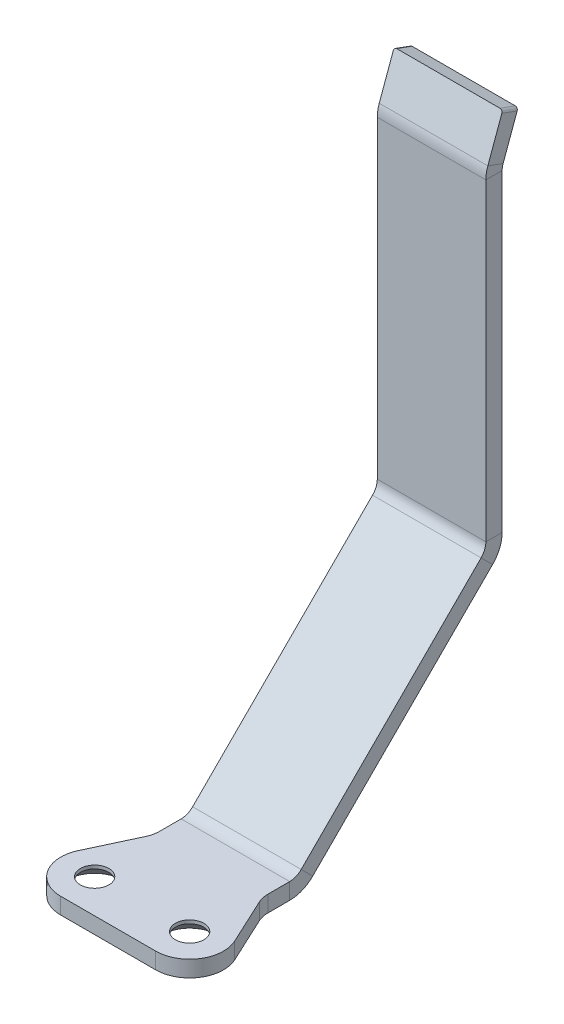
ISO-10303-21;
HEADER;
FILE_DESCRIPTION(('STEP AP214'),'2;1');
FILE_NAME('part.step','',(''),(''),'','','');
FILE_SCHEMA(('AUTOMOTIVE_DESIGN { 1 0 10303 214 1 1 1 1 }'));
ENDSEC;
DATA;
#1=APPLICATION_CONTEXT('core data for automotive mechanical design processes');
#2=APPLICATION_PROTOCOL_DEFINITION('international standard','automotive_design',2000,#1);
#3=PRODUCT_CONTEXT('',#1,'mechanical');
#4=PRODUCT('Part','Part','',(#3));
#5=PRODUCT_RELATED_PRODUCT_CATEGORY('part','',(#4));
#6=PRODUCT_DEFINITION_FORMATION('','',#4);
#7=PRODUCT_DEFINITION_CONTEXT('part definition',#1,'design');
#8=PRODUCT_DEFINITION('design','',#6,#7);
#9=PRODUCT_DEFINITION_SHAPE('','',#8);
#10=(LENGTH_UNIT() NAMED_UNIT(*) SI_UNIT(.MILLI.,.METRE.));
#11=(NAMED_UNIT(*) PLANE_ANGLE_UNIT() SI_UNIT($,.RADIAN.));
#12=(NAMED_UNIT(*) SI_UNIT($,.STERADIAN.) SOLID_ANGLE_UNIT());
#13=UNCERTAINTY_MEASURE_WITH_UNIT(LENGTH_MEASURE(1.E-05),#10,'distance_accuracy_value','');
#14=(GEOMETRIC_REPRESENTATION_CONTEXT(3) GLOBAL_UNCERTAINTY_ASSIGNED_CONTEXT((#13)) GLOBAL_UNIT_ASSIGNED_CONTEXT((#10,
#11,#12)) REPRESENTATION_CONTEXT('',''));
#15=CARTESIAN_POINT('',(0.,0.,0.));
#16=DIRECTION('',(0.,0.,1.));
#17=DIRECTION('',(1.,0.,0.));
#18=AXIS2_PLACEMENT_3D('',#15,#16,#17);
#19=CARTESIAN_POINT('',(-19.,287.841217847367,-0.231610237586444));
#20=DIRECTION('',(0.,-0.939692620785908,0.342020143325669));
#21=DIRECTION('',(0.,-0.342020143325669,-0.939692620785908));
#22=AXIS2_PLACEMENT_3D('',#19,#20,#21);
#23=PLANE('',#22);
#24=DIRECTION('',(-1.,0.,0.));
#25=VECTOR('',#24,1.);
#26=CARTESIAN_POINT('',(-19.,285.789096987413,-5.86976596230189));
#27=LINE('',#26,#25);
#28=CARTESIAN_POINT('',(19.,285.789096987413,-5.86976596230189));
#29=VERTEX_POINT('',#28);
#30=CARTESIAN_POINT('',(-19.,285.789096987413,-5.86976596230189));
#31=VERTEX_POINT('',#30);
#32=EDGE_CURVE('E255',#29,#31,#27,.T.);
#33=ORIENTED_EDGE('',*,*,#32,.T.);
#34=DIRECTION('',(0.,-0.342020143325669,-0.939692620785908));
#35=VECTOR('',#34,1.);
#36=CARTESIAN_POINT('',(-19.,287.841217847367,-0.231610237586444));
#37=LINE('',#36,#35);
#38=CARTESIAN_POINT('',(-19.,287.841217847367,-0.231610237586444));
#39=VERTEX_POINT('',#38);
#40=EDGE_CURVE('E466',#39,#31,#37,.T.);
#41=ORIENTED_EDGE('',*,*,#40,.F.);
#42=DIRECTION('',(-1.,0.,0.));
#43=VECTOR('',#42,1.);
#44=CARTESIAN_POINT('',(-19.,287.841217847367,-0.231610237586444));
#45=LINE('',#44,#43);
#46=CARTESIAN_POINT('',(19.,287.841217847367,-0.231610237586444));
#47=VERTEX_POINT('',#46);
#48=EDGE_CURVE('E457',#47,#39,#45,.T.);
#49=ORIENTED_EDGE('',*,*,#48,.F.);
#50=DIRECTION('',(0.,-0.342020143325669,-0.939692620785908));
#51=VECTOR('',#50,1.);
#52=CARTESIAN_POINT('',(19.,287.841217847367,-0.231610237586444));
#53=LINE('',#52,#51);
#54=EDGE_CURVE('E257',#47,#29,#53,.T.);
#55=ORIENTED_EDGE('',*,*,#54,.T.);
#56=EDGE_LOOP('',(#33,#41,#49,#55));
#57=FACE_BOUND('',#56,.T.);
#58=ADVANCED_FACE('F32',(#57),#23,.F.);
#59=CARTESIAN_POINT('',(19.,286.901525226582,0.110409905739225));
#60=DIRECTION('',(0.,-0.342020143325669,-0.939692620785908));
#61=DIRECTION('',(-1.,0.,0.));
#62=AXIS2_PLACEMENT_3D('',#59,#60,#61);
#63=CYLINDRICAL_SURFACE('',#62,1.);
#64=CARTESIAN_POINT('',(19.,284.849404366628,-5.52774581897622));
#65=DIRECTION('',(0.,0.342020143325669,0.939692620785908));
#66=DIRECTION('',(1.,0.,0.));
#67=AXIS2_PLACEMENT_3D('',#64,#65,#66);
#68=CIRCLE('',#67,1.);
#69=CARTESIAN_POINT('',(20.,284.849404366628,-5.52774581897622));
#70=VERTEX_POINT('',#69);
#71=EDGE_CURVE('E474',#70,#29,#68,.T.);
#72=ORIENTED_EDGE('',*,*,#71,.T.);
#73=ORIENTED_EDGE('',*,*,#54,.F.);
#74=CARTESIAN_POINT('',(19.,286.901525226582,0.110409905739225));
#75=DIRECTION('',(0.,0.342020143325669,0.939692620785908));
#76=DIRECTION('',(1.,0.,0.));
#77=AXIS2_PLACEMENT_3D('',#74,#75,#76);
#78=CIRCLE('',#77,1.);
#79=CARTESIAN_POINT('',(20.,286.901525226582,0.110409905739225));
#80=VERTEX_POINT('',#79);
#81=EDGE_CURVE('E459',#80,#47,#78,.T.);
#82=ORIENTED_EDGE('',*,*,#81,.F.);
#83=DIRECTION('',(0.,-0.342020143325669,-0.939692620785908));
#84=VECTOR('',#83,1.);
#85=CARTESIAN_POINT('',(20.,286.901525226582,0.110409905739225));
#86=LINE('',#85,#84);
#87=EDGE_CURVE('E471',#80,#70,#86,.T.);
#88=ORIENTED_EDGE('',*,*,#87,.T.);
#89=EDGE_LOOP('',(#72,#73,#82,#88));
#90=FACE_BOUND('',#89,.T.);
#91=ADVANCED_FACE('F489',(#90),#63,.T.);
#92=CARTESIAN_POINT('',(-19.,286.901525226582,0.110409905739225));
#93=DIRECTION('',(0.,-0.342020143325669,-0.939692620785908));
#94=DIRECTION('',(-1.,0.,0.));
#95=AXIS2_PLACEMENT_3D('',#92,#93,#94);
#96=CYLINDRICAL_SURFACE('',#95,1.);
#97=CARTESIAN_POINT('',(-19.,284.849404366628,-5.52774581897622));
#98=DIRECTION('',(0.,0.342020143325669,0.939692620785908));
#99=DIRECTION('',(-1.,0.,0.));
#100=AXIS2_PLACEMENT_3D('',#97,#98,#99);
#101=CIRCLE('',#100,1.);
#102=CARTESIAN_POINT('',(-20.,284.849404366628,-5.52774581897622));
#103=VERTEX_POINT('',#102);
#104=EDGE_CURVE('E469',#31,#103,#101,.T.);
#105=ORIENTED_EDGE('',*,*,#104,.T.);
#106=DIRECTION('',(0.,-0.342020143325669,-0.939692620785908));
#107=VECTOR('',#106,1.);
#108=CARTESIAN_POINT('',(-20.,286.901525226582,0.110409905739225));
#109=LINE('',#108,#107);
#110=CARTESIAN_POINT('',(-20.,286.901525226582,0.110409905739225));
#111=VERTEX_POINT('',#110);
#112=EDGE_CURVE('E464',#111,#103,#109,.T.);
#113=ORIENTED_EDGE('',*,*,#112,.F.);
#114=CARTESIAN_POINT('',(-19.,286.901525226582,0.110409905739225));
#115=DIRECTION('',(0.,0.342020143325669,0.939692620785908));
#116=DIRECTION('',(-1.,0.,0.));
#117=AXIS2_PLACEMENT_3D('',#114,#115,#116);
#118=CIRCLE('',#117,1.);
#119=EDGE_CURVE('E226',#39,#111,#118,.T.);
#120=ORIENTED_EDGE('',*,*,#119,.F.);
#121=ORIENTED_EDGE('',*,*,#40,.T.);
#122=EDGE_LOOP('',(#105,#113,#120,#121));
#123=FACE_BOUND('',#122,.T.);
#124=ADVANCED_FACE('F487',(#123),#96,.T.);
#125=CARTESIAN_POINT('',(-20.,54.264829282961,84.7832426272543));
#126=DIRECTION('',(1.,0.,0.));
#127=DIRECTION('',(0.,0.939692620785908,-0.342020143325669));
#128=AXIS2_PLACEMENT_3D('',#125,#126,#127);
#129=PLANE('',#128);
#130=DIRECTION('',(0.,-0.342020143325669,-0.939692620785908));
#131=VECTOR('',#130,1.);
#132=CARTESIAN_POINT('',(-20.,272.708327384163,5.2763114494309));
#133=LINE('',#132,#131);
#134=CARTESIAN_POINT('',(-20.,272.708327384163,5.2763114494309));
#135=VERTEX_POINT('',#134);
#136=CARTESIAN_POINT('',(-20.,270.656206524209,-0.361844275284545));
#137=VERTEX_POINT('',#136);
#138=EDGE_CURVE('E233',#135,#137,#133,.T.);
#139=ORIENTED_EDGE('',*,*,#138,.F.);
#140=DIRECTION('',(0.,-0.939692620785908,0.342020143325669));
#141=VECTOR('',#140,1.);
#142=CARTESIAN_POINT('',(-20.,54.264829282961,84.7832426272543));
#143=LINE('',#142,#141);
#144=EDGE_CURVE('E222',#111,#135,#143,.T.);
#145=ORIENTED_EDGE('',*,*,#144,.F.);
#146=ORIENTED_EDGE('',*,*,#112,.T.);
#147=DIRECTION('',(0.,-0.939692620785908,0.342020143325669));
#148=VECTOR('',#147,1.);
#149=CARTESIAN_POINT('',(-20.,52.2127084230069,79.1450869025389));
#150=LINE('',#149,#148);
#151=EDGE_CURVE('E236',#103,#137,#150,.T.);
#152=ORIENTED_EDGE('',*,*,#151,.T.);
#153=EDGE_LOOP('',(#139,#145,#146,#152));
#154=FACE_BOUND('',#153,.T.);
#155=ADVANCED_FACE('F235',(#154),#129,.F.);
#156=CARTESIAN_POINT('',(-17.5,29.4257471312428,93.8239291769727));
#157=DIRECTION('',(0.,-0.342020143325669,-0.939692620785908));
#158=DIRECTION('',(-1.,0.,0.));
#159=AXIS2_PLACEMENT_3D('',#156,#157,#158);
#160=PLANE('',#159);
#161=DIRECTION('',(-1.,0.,0.));
#162=VECTOR('',#161,1.);
#163=CARTESIAN_POINT('',(-17.5,272.708327384163,5.2763114494309));
#164=LINE('',#163,#162);
#165=CARTESIAN_POINT('',(20.,272.708327384163,5.2763114494309));
#166=VERTEX_POINT('',#165);
#167=EDGE_CURVE('E82',#166,#135,#164,.T.);
#168=ORIENTED_EDGE('',*,*,#167,.F.);
#169=DIRECTION('',(0.,0.939692620785908,-0.342020143325669));
#170=VECTOR('',#169,1.);
#171=CARTESIAN_POINT('',(20.,54.264829282961,84.7832426272543));
#172=LINE('',#171,#170);
#173=EDGE_CURVE('E461',#166,#80,#172,.T.);
#174=ORIENTED_EDGE('',*,*,#173,.T.);
#175=ORIENTED_EDGE('',*,*,#81,.T.);
#176=ORIENTED_EDGE('',*,*,#48,.T.);
#177=ORIENTED_EDGE('',*,*,#119,.T.);
#178=ORIENTED_EDGE('',*,*,#144,.T.);
#179=EDGE_LOOP('',(#168,#174,#175,#176,#177,#178));
#180=FACE_BOUND('',#179,.T.);
#181=ADVANCED_FACE('F224',(#180),#160,.F.);
#182=CARTESIAN_POINT('',(20.,54.264829282961,84.7832426272543));
#183=DIRECTION('',(-1.,0.,0.));
#184=DIRECTION('',(0.,-0.939692620785908,0.342020143325669));
#185=AXIS2_PLACEMENT_3D('',#182,#183,#184);
#186=PLANE('',#185);
#187=DIRECTION('',(0.,0.342020143325669,0.939692620785908));
#188=VECTOR('',#187,1.);
#189=CARTESIAN_POINT('',(20.,272.708327384163,5.2763114494309));
#190=LINE('',#189,#188);
#191=CARTESIAN_POINT('',(20.,270.656206524209,-0.361844275284545));
#192=VERTEX_POINT('',#191);
#193=EDGE_CURVE('E88',#192,#166,#190,.T.);
#194=ORIENTED_EDGE('',*,*,#193,.F.);
#195=DIRECTION('',(0.,0.939692620785908,-0.342020143325669));
#196=VECTOR('',#195,1.);
#197=CARTESIAN_POINT('',(20.,52.2127084230069,79.1450869025389));
#198=LINE('',#197,#196);
#199=EDGE_CURVE('E230',#192,#70,#198,.T.);
#200=ORIENTED_EDGE('',*,*,#199,.T.);
#201=ORIENTED_EDGE('',*,*,#87,.F.);
#202=ORIENTED_EDGE('',*,*,#173,.F.);
#203=EDGE_LOOP('',(#194,#200,#201,#202));
#204=FACE_BOUND('',#203,.T.);
#205=ADVANCED_FACE('F799',(#204),#186,.F.);
#206=CARTESIAN_POINT('',(-17.5,27.3736262712888,88.1857734522572));
#207=DIRECTION('',(0.,-0.342020143325669,-0.939692620785908));
#208=DIRECTION('',(-1.,0.,0.));
#209=AXIS2_PLACEMENT_3D('',#206,#207,#208);
#210=PLANE('',#209);
#211=ORIENTED_EDGE('',*,*,#199,.F.);
#212=DIRECTION('',(-1.,0.,0.));
#213=VECTOR('',#212,1.);
#214=CARTESIAN_POINT('',(-17.5,270.656206524209,-0.361844275284545));
#215=LINE('',#214,#213);
#216=EDGE_CURVE('E49',#192,#137,#215,.T.);
#217=ORIENTED_EDGE('',*,*,#216,.T.);
#218=ORIENTED_EDGE('',*,*,#151,.F.);
#219=ORIENTED_EDGE('',*,*,#104,.F.);
#220=ORIENTED_EDGE('',*,*,#32,.F.);
#221=ORIENTED_EDGE('',*,*,#71,.F.);
#222=EDGE_LOOP('',(#211,#217,#218,#219,#220,#221));
#223=FACE_BOUND('',#222,.T.);
#224=ADVANCED_FACE('F485',(#223),#210,.T.);
#225=CARTESIAN_POINT('',(-30.,80.8719013541956,86.194899531243));
#226=DIRECTION('',(0.,-1.,0.));
#227=DIRECTION('',(-1.,0.,0.));
#228=AXIS2_PLACEMENT_3D('',#225,#226,#227);
#229=CYLINDRICAL_SURFACE('',#228,10.);
#230=CARTESIAN_POINT('',(-30.,74.8719013541956,86.194899531243));
#231=DIRECTION('',(0.,-1.,0.));
#232=DIRECTION('',(1.,0.,0.));
#233=AXIS2_PLACEMENT_3D('',#230,#231,#232);
#234=CIRCLE('',#233,10.);
#235=CARTESIAN_POINT('',(-20.,74.8719013541956,86.194899531243));
#236=VERTEX_POINT('',#235);
#237=CARTESIAN_POINT('',(-20.9369221296335,74.8719013541956,90.42108214865));
#238=VERTEX_POINT('',#237);
#239=EDGE_CURVE('E152',#236,#238,#234,.T.);
#240=ORIENTED_EDGE('',*,*,#239,.T.);
#241=DIRECTION('',(0.,-1.,0.));
#242=VECTOR('',#241,1.);
#243=CARTESIAN_POINT('',(-20.9369221296335,80.8719013541956,90.42108214865));
#244=LINE('',#243,#242);
#245=CARTESIAN_POINT('',(-20.9369221296335,80.8719013541956,90.42108214865));
#246=VERTEX_POINT('',#245);
#247=EDGE_CURVE('E435',#246,#238,#244,.T.);
#248=ORIENTED_EDGE('',*,*,#247,.F.);
#249=CARTESIAN_POINT('',(-30.,80.8719013541956,86.194899531243));
#250=DIRECTION('',(0.,-1.,0.));
#251=DIRECTION('',(1.,0.,0.));
#252=AXIS2_PLACEMENT_3D('',#249,#250,#251);
#253=CIRCLE('',#252,10.);
#254=CARTESIAN_POINT('',(-20.,80.8719013541956,86.194899531243));
#255=VERTEX_POINT('',#254);
#256=EDGE_CURVE('E396',#255,#246,#253,.T.);
#257=ORIENTED_EDGE('',*,*,#256,.F.);
#258=DIRECTION('',(0.,-1.,0.));
#259=VECTOR('',#258,1.);
#260=CARTESIAN_POINT('',(-20.,80.8719013541956,86.194899531243));
#261=LINE('',#260,#259);
#262=EDGE_CURVE('E439',#255,#236,#261,.T.);
#263=ORIENTED_EDGE('',*,*,#262,.T.);
#264=EDGE_LOOP('',(#240,#248,#257,#263));
#265=FACE_BOUND('',#264,.T.);
#266=ADVANCED_FACE('F558',(#265),#229,.F.);
#267=CARTESIAN_POINT('',(-28.8288473379581,80.8719013541957,107.345370374046));
#268=DIRECTION('',(0.906307787036649,0.,0.422618261740701));
#269=DIRECTION('',(0.422618261740701,0.,-0.906307787036649));
#270=AXIS2_PLACEMENT_3D('',#267,#268,#269);
#271=PLANE('',#270);
#272=DIRECTION('',(-0.422618261740701,0.,0.906307787036649));
#273=VECTOR('',#272,1.);
#274=CARTESIAN_POINT('',(-28.8288473379581,74.8719013541957,107.345370374046));
#275=LINE('',#274,#273);
#276=CARTESIAN_POINT('',(-28.8288473379581,74.8719013541957,107.345370374046));
#277=VERTEX_POINT('',#276);
#278=EDGE_CURVE('E437',#238,#277,#275,.T.);
#279=ORIENTED_EDGE('',*,*,#278,.T.);
#280=DIRECTION('',(0.,-1.,0.));
#281=VECTOR('',#280,1.);
#282=CARTESIAN_POINT('',(-28.8288473379581,80.8719013541957,107.345370374046));
#283=LINE('',#282,#281);
#284=CARTESIAN_POINT('',(-28.8288473379581,80.8719013541957,107.345370374046));
#285=VERTEX_POINT('',#284);
#286=EDGE_CURVE('E429',#285,#277,#283,.T.);
#287=ORIENTED_EDGE('',*,*,#286,.F.);
#288=DIRECTION('',(-0.422618261740701,0.,0.906307787036649));
#289=VECTOR('',#288,1.);
#290=CARTESIAN_POINT('',(-28.8288473379581,80.8719013541957,107.345370374046));
#291=LINE('',#290,#289);
#292=EDGE_CURVE('E394',#246,#285,#291,.T.);
#293=ORIENTED_EDGE('',*,*,#292,.F.);
#294=ORIENTED_EDGE('',*,*,#247,.T.);
#295=EDGE_LOOP('',(#279,#287,#293,#294));
#296=FACE_BOUND('',#295,.T.);
#297=ADVANCED_FACE('F554',(#296),#271,.F.);
#298=CARTESIAN_POINT('',(-17.5,80.8719013541957,112.628098645805));
#299=DIRECTION('',(0.,-1.,0.));
#300=DIRECTION('',(-1.,0.,0.));
#301=AXIS2_PLACEMENT_3D('',#298,#299,#300);
#302=CYLINDRICAL_SURFACE('',#301,12.5);
#303=CARTESIAN_POINT('',(-17.5,74.8719013541957,112.628098645805));
#304=DIRECTION('',(0.,1.,0.));
#305=DIRECTION('',(-1.,0.,0.));
#306=AXIS2_PLACEMENT_3D('',#303,#304,#305);
#307=CIRCLE('',#306,12.5);
#308=CARTESIAN_POINT('',(-17.5,74.8719013541957,125.128098645805));
#309=VERTEX_POINT('',#308);
#310=EDGE_CURVE('E432',#277,#309,#307,.T.);
#311=ORIENTED_EDGE('',*,*,#310,.T.);
#312=DIRECTION('',(0.,-1.,0.));
#313=VECTOR('',#312,1.);
#314=CARTESIAN_POINT('',(-17.5,80.8719013541958,125.128098645805));
#315=LINE('',#314,#313);
#316=CARTESIAN_POINT('',(-17.5,80.8719013541958,125.128098645805));
#317=VERTEX_POINT('',#316);
#318=EDGE_CURVE('E424',#317,#309,#315,.T.);
#319=ORIENTED_EDGE('',*,*,#318,.F.);
#320=CARTESIAN_POINT('',(-17.5,80.8719013541957,112.628098645805));
#321=DIRECTION('',(0.,1.,0.));
#322=DIRECTION('',(-1.,0.,0.));
#323=AXIS2_PLACEMENT_3D('',#320,#321,#322);
#324=CIRCLE('',#323,12.5);
#325=EDGE_CURVE('E391',#285,#317,#324,.T.);
#326=ORIENTED_EDGE('',*,*,#325,.F.);
#327=ORIENTED_EDGE('',*,*,#286,.T.);
#328=EDGE_LOOP('',(#311,#319,#326,#327));
#329=FACE_BOUND('',#328,.T.);
#330=ADVANCED_FACE('F550',(#329),#302,.T.);
#331=CARTESIAN_POINT('',(-17.5,80.8719013541958,125.128098645805));
#332=DIRECTION('',(0.,0.,-1.));
#333=DIRECTION('',(0.,1.,0.));
#334=AXIS2_PLACEMENT_3D('',#331,#332,#333);
#335=PLANE('',#334);
#336=DIRECTION('',(1.,0.,0.));
#337=VECTOR('',#336,1.);
#338=CARTESIAN_POINT('',(-17.5,74.8719013541957,125.128098645805));
#339=LINE('',#338,#337);
#340=CARTESIAN_POINT('',(17.5,74.8719013541957,125.128098645805));
#341=VERTEX_POINT('',#340);
#342=EDGE_CURVE('E427',#309,#341,#339,.T.);
#343=ORIENTED_EDGE('',*,*,#342,.T.);
#344=DIRECTION('',(0.,-1.,0.));
#345=VECTOR('',#344,1.);
#346=CARTESIAN_POINT('',(17.5,80.8719013541957,125.128098645805));
#347=LINE('',#346,#345);
#348=CARTESIAN_POINT('',(17.5,80.8719013541957,125.128098645805));
#349=VERTEX_POINT('',#348);
#350=EDGE_CURVE('E419',#349,#341,#347,.T.);
#351=ORIENTED_EDGE('',*,*,#350,.F.);
#352=DIRECTION('',(1.,0.,0.));
#353=VECTOR('',#352,1.);
#354=CARTESIAN_POINT('',(-17.5,80.8719013541958,125.128098645805));
#355=LINE('',#354,#353);
#356=EDGE_CURVE('E389',#317,#349,#355,.T.);
#357=ORIENTED_EDGE('',*,*,#356,.F.);
#358=ORIENTED_EDGE('',*,*,#318,.T.);
#359=EDGE_LOOP('',(#343,#351,#357,#358));
#360=FACE_BOUND('',#359,.T.);
#361=ADVANCED_FACE('F546',(#360),#335,.F.);
#362=CARTESIAN_POINT('',(17.5,80.8719013541957,112.628098645805));
#363=DIRECTION('',(0.,-1.,0.));
#364=DIRECTION('',(-1.,0.,0.));
#365=AXIS2_PLACEMENT_3D('',#362,#363,#364);
#366=CYLINDRICAL_SURFACE('',#365,12.5);
#367=CARTESIAN_POINT('',(17.5,74.8719013541957,112.628098645805));
#368=DIRECTION('',(0.,1.,0.));
#369=DIRECTION('',(1.,0.,0.));
#370=AXIS2_PLACEMENT_3D('',#367,#368,#369);
#371=CIRCLE('',#370,12.5);
#372=CARTESIAN_POINT('',(28.8288473379581,74.8719013541957,107.345370374046));
#373=VERTEX_POINT('',#372);
#374=EDGE_CURVE('E422',#341,#373,#371,.T.);
#375=ORIENTED_EDGE('',*,*,#374,.T.);
#376=DIRECTION('',(0.,-1.,0.));
#377=VECTOR('',#376,1.);
#378=CARTESIAN_POINT('',(28.8288473379581,80.8719013541957,107.345370374046));
#379=LINE('',#378,#377);
#380=CARTESIAN_POINT('',(28.8288473379581,80.8719013541957,107.345370374046));
#381=VERTEX_POINT('',#380);
#382=EDGE_CURVE('E414',#381,#373,#379,.T.);
#383=ORIENTED_EDGE('',*,*,#382,.F.);
#384=CARTESIAN_POINT('',(17.5,80.8719013541957,112.628098645805));
#385=DIRECTION('',(0.,1.,0.));
#386=DIRECTION('',(1.,0.,0.));
#387=AXIS2_PLACEMENT_3D('',#384,#385,#386);
#388=CIRCLE('',#387,12.5);
#389=EDGE_CURVE('E387',#349,#381,#388,.T.);
#390=ORIENTED_EDGE('',*,*,#389,.F.);
#391=ORIENTED_EDGE('',*,*,#350,.T.);
#392=EDGE_LOOP('',(#375,#383,#390,#391));
#393=FACE_BOUND('',#392,.T.);
#394=ADVANCED_FACE('F542',(#393),#366,.T.);
#395=CARTESIAN_POINT('',(28.8288473379581,80.8719013541957,107.345370374046));
#396=DIRECTION('',(-0.906307787036649,0.,0.422618261740701));
#397=DIRECTION('',(0.422618261740701,0.,0.906307787036649));
#398=AXIS2_PLACEMENT_3D('',#395,#396,#397);
#399=PLANE('',#398);
#400=DIRECTION('',(-0.422618261740701,0.,-0.906307787036649));
#401=VECTOR('',#400,1.);
#402=CARTESIAN_POINT('',(28.8288473379581,74.8719013541957,107.345370374046));
#403=LINE('',#402,#401);
#404=CARTESIAN_POINT('',(20.9369221296335,74.8719013541956,90.42108214865));
#405=VERTEX_POINT('',#404);
#406=EDGE_CURVE('E417',#373,#405,#403,.T.);
#407=ORIENTED_EDGE('',*,*,#406,.T.);
#408=DIRECTION('',(0.,-1.,0.));
#409=VECTOR('',#408,1.);
#410=CARTESIAN_POINT('',(20.9369221296335,80.8719013541956,90.42108214865));
#411=LINE('',#410,#409);
#412=CARTESIAN_POINT('',(20.9369221296335,80.8719013541956,90.42108214865));
#413=VERTEX_POINT('',#412);
#414=EDGE_CURVE('E409',#413,#405,#411,.T.);
#415=ORIENTED_EDGE('',*,*,#414,.F.);
#416=DIRECTION('',(-0.422618261740701,0.,-0.906307787036649));
#417=VECTOR('',#416,1.);
#418=CARTESIAN_POINT('',(28.8288473379581,80.8719013541957,107.345370374046));
#419=LINE('',#418,#417);
#420=EDGE_CURVE('E385',#381,#413,#419,.T.);
#421=ORIENTED_EDGE('',*,*,#420,.F.);
#422=ORIENTED_EDGE('',*,*,#382,.T.);
#423=EDGE_LOOP('',(#407,#415,#421,#422));
#424=FACE_BOUND('',#423,.T.);
#425=ADVANCED_FACE('F538',(#424),#399,.F.);
#426=CARTESIAN_POINT('',(30.,80.8719013541956,86.194899531243));
#427=DIRECTION('',(0.,-1.,0.));
#428=DIRECTION('',(-1.,0.,0.));
#429=AXIS2_PLACEMENT_3D('',#426,#427,#428);
#430=CYLINDRICAL_SURFACE('',#429,10.);
#431=CARTESIAN_POINT('',(30.,74.8719013541956,86.194899531243));
#432=DIRECTION('',(0.,-1.,0.));
#433=DIRECTION('',(-1.,0.,0.));
#434=AXIS2_PLACEMENT_3D('',#431,#432,#433);
#435=CIRCLE('',#434,10.);
#436=CARTESIAN_POINT('',(20.,74.8719013541956,86.194899531243));
#437=VERTEX_POINT('',#436);
#438=EDGE_CURVE('E412',#405,#437,#435,.T.);
#439=ORIENTED_EDGE('',*,*,#438,.T.);
#440=DIRECTION('',(0.,-1.,0.));
#441=VECTOR('',#440,1.);
#442=CARTESIAN_POINT('',(20.,80.8719013541956,86.194899531243));
#443=LINE('',#442,#441);
#444=CARTESIAN_POINT('',(20.,80.8719013541956,86.194899531243));
#445=VERTEX_POINT('',#444);
#446=EDGE_CURVE('E300',#445,#437,#443,.T.);
#447=ORIENTED_EDGE('',*,*,#446,.F.);
#448=CARTESIAN_POINT('',(30.,80.8719013541956,86.194899531243));
#449=DIRECTION('',(0.,-1.,0.));
#450=DIRECTION('',(-1.,0.,0.));
#451=AXIS2_PLACEMENT_3D('',#448,#449,#450);
#452=CIRCLE('',#451,10.);
#453=EDGE_CURVE('E383',#413,#445,#452,.T.);
#454=ORIENTED_EDGE('',*,*,#453,.F.);
#455=ORIENTED_EDGE('',*,*,#414,.T.);
#456=EDGE_LOOP('',(#439,#447,#454,#455));
#457=FACE_BOUND('',#456,.T.);
#458=ADVANCED_FACE('F535',(#457),#430,.F.);
#459=CARTESIAN_POINT('',(-17.5,80.8719013541957,112.628098645805));
#460=DIRECTION('',(0.,-1.,0.));
#461=DIRECTION('',(-1.,0.,0.));
#462=AXIS2_PLACEMENT_3D('',#459,#460,#461);
#463=CYLINDRICAL_SURFACE('',#462,5.25);
#464=CARTESIAN_POINT('',(-17.5,79.6219013541957,112.628098645805));
#465=DIRECTION('',(0.,-1.,0.));
#466=DIRECTION('',(0.,0.,-1.));
#467=AXIS2_PLACEMENT_3D('',#464,#465,#466);
#468=CIRCLE('',#467,5.25);
#469=CARTESIAN_POINT('',(-17.5,79.6219013541957,107.378098645805));
#470=VERTEX_POINT('',#469);
#471=EDGE_CURVE('E41',#470,#470,#468,.T.);
#472=ORIENTED_EDGE('',*,*,#471,.T.);
#473=EDGE_LOOP('',(#472));
#474=FACE_BOUND('',#473,.T.);
#475=CARTESIAN_POINT('',(-17.5,80.8719013541957,112.628098645805));
#476=DIRECTION('',(0.,1.,0.));
#477=DIRECTION('',(-1.,0.,0.));
#478=AXIS2_PLACEMENT_3D('',#475,#476,#477);
#479=CIRCLE('',#478,5.25);
#480=CARTESIAN_POINT('',(-22.75,80.8719013541957,112.628098645805));
#481=VERTEX_POINT('',#480);
#482=EDGE_CURVE('E406',#481,#481,#479,.T.);
#483=ORIENTED_EDGE('',*,*,#482,.T.);
#484=EDGE_LOOP('',(#483));
#485=FACE_BOUND('',#484,.T.);
#486=ADVANCED_FACE('F270',(#474,#485),#463,.F.);
#487=CARTESIAN_POINT('',(17.5,80.8719013541957,112.628098645805));
#488=DIRECTION('',(0.,-1.,0.));
#489=DIRECTION('',(-1.,0.,0.));
#490=AXIS2_PLACEMENT_3D('',#487,#488,#489);
#491=CYLINDRICAL_SURFACE('',#490,5.25);
#492=CARTESIAN_POINT('',(17.5,79.6219013541957,112.628098645805));
#493=DIRECTION('',(0.,-1.,0.));
#494=DIRECTION('',(0.,0.,-1.));
#495=AXIS2_PLACEMENT_3D('',#492,#493,#494);
#496=CIRCLE('',#495,5.25);
#497=CARTESIAN_POINT('',(17.5,79.6219013541957,107.378098645805));
#498=VERTEX_POINT('',#497);
#499=EDGE_CURVE('E11',#498,#498,#496,.T.);
#500=ORIENTED_EDGE('',*,*,#499,.T.);
#501=EDGE_LOOP('',(#500));
#502=FACE_BOUND('',#501,.T.);
#503=CARTESIAN_POINT('',(17.5,80.8719013541957,112.628098645805));
#504=DIRECTION('',(0.,1.,0.));
#505=DIRECTION('',(1.,0.,0.));
#506=AXIS2_PLACEMENT_3D('',#503,#504,#505);
#507=CIRCLE('',#506,5.25);
#508=CARTESIAN_POINT('',(22.75,80.8719013541957,112.628098645805));
#509=VERTEX_POINT('',#508);
#510=EDGE_CURVE('E301',#509,#509,#507,.T.);
#511=ORIENTED_EDGE('',*,*,#510,.T.);
#512=EDGE_LOOP('',(#511));
#513=FACE_BOUND('',#512,.T.);
#514=ADVANCED_FACE('F283',(#502,#513),#491,.F.);
#515=CARTESIAN_POINT('',(-17.5,74.8719013541957,112.628098645805));
#516=DIRECTION('',(0.,-1.,0.));
#517=DIRECTION('',(-1.,0.,0.));
#518=AXIS2_PLACEMENT_3D('',#515,#516,#517);
#519=PLANE('',#518);
#520=CARTESIAN_POINT('',(-17.5,74.8719013541957,112.628098645805));
#521=DIRECTION('',(0.,-1.,0.));
#522=DIRECTION('',(0.,0.,-1.));
#523=AXIS2_PLACEMENT_3D('',#520,#521,#522);
#524=CIRCLE('',#523,10.);
#525=CARTESIAN_POINT('',(-17.5,74.8719013541957,102.628098645805));
#526=VERTEX_POINT('',#525);
#527=EDGE_CURVE('E265',#526,#526,#524,.F.);
#528=ORIENTED_EDGE('',*,*,#527,.T.);
#529=EDGE_LOOP('',(#528));
#530=FACE_BOUND('',#529,.T.);
#531=CARTESIAN_POINT('',(17.5,74.8719013541957,112.628098645805));
#532=DIRECTION('',(0.,-1.,0.));
#533=DIRECTION('',(0.,0.,-1.));
#534=AXIS2_PLACEMENT_3D('',#531,#532,#533);
#535=CIRCLE('',#534,10.);
#536=CARTESIAN_POINT('',(17.5,74.8719013541957,102.628098645805));
#537=VERTEX_POINT('',#536);
#538=EDGE_CURVE('E262',#537,#537,#535,.F.);
#539=ORIENTED_EDGE('',*,*,#538,.T.);
#540=EDGE_LOOP('',(#539));
#541=FACE_BOUND('',#540,.T.);
#542=DIRECTION('',(0.,0.,1.));
#543=VECTOR('',#542,1.);
#544=CARTESIAN_POINT('',(-20.,74.8719013541956,86.194899531243));
#545=LINE('',#544,#543);
#546=CARTESIAN_POINT('',(-20.,74.8719013541956,78.2689059012311));
#547=VERTEX_POINT('',#546);
#548=EDGE_CURVE('E96',#547,#236,#545,.T.);
#549=ORIENTED_EDGE('',*,*,#548,.F.);
#550=DIRECTION('',(1.,0.,0.));
#551=VECTOR('',#550,1.);
#552=CARTESIAN_POINT('',(-17.5,74.8719013541956,78.2689059012311));
#553=LINE('',#552,#551);
#554=CARTESIAN_POINT('',(20.,74.8719013541956,78.2689059012311));
#555=VERTEX_POINT('',#554);
#556=EDGE_CURVE('E290',#547,#555,#553,.T.);
#557=ORIENTED_EDGE('',*,*,#556,.T.);
#558=DIRECTION('',(0.,0.,-1.));
#559=VECTOR('',#558,1.);
#560=CARTESIAN_POINT('',(20.,74.8719013541956,86.194899531243));
#561=LINE('',#560,#559);
#562=EDGE_CURVE('E400',#437,#555,#561,.T.);
#563=ORIENTED_EDGE('',*,*,#562,.F.);
#564=ORIENTED_EDGE('',*,*,#438,.F.);
#565=ORIENTED_EDGE('',*,*,#406,.F.);
#566=ORIENTED_EDGE('',*,*,#374,.F.);
#567=ORIENTED_EDGE('',*,*,#342,.F.);
#568=ORIENTED_EDGE('',*,*,#310,.F.);
#569=ORIENTED_EDGE('',*,*,#278,.F.);
#570=ORIENTED_EDGE('',*,*,#239,.F.);
#571=EDGE_LOOP('',(#549,#557,#563,#564,#565,#566,#567,#568,#569,#570));
#572=FACE_BOUND('',#571,.T.);
#573=ADVANCED_FACE('F279',(#530,#541,#572),#519,.T.);
#574=CARTESIAN_POINT('',(20.,80.8719013541956,86.194899531243));
#575=DIRECTION('',(-1.,0.,0.));
#576=DIRECTION('',(0.,0.,1.));
#577=AXIS2_PLACEMENT_3D('',#574,#575,#576);
#578=PLANE('',#577);
#579=DIRECTION('',(0.,-1.,0.));
#580=VECTOR('',#579,1.);
#581=CARTESIAN_POINT('',(20.,80.8719013541956,78.2689059012311));
#582=LINE('',#581,#580);
#583=CARTESIAN_POINT('',(20.,80.8719013541956,78.268905901231));
#584=VERTEX_POINT('',#583);
#585=EDGE_CURVE('E442',#584,#555,#582,.T.);
#586=ORIENTED_EDGE('',*,*,#585,.F.);
#587=DIRECTION('',(0.,0.,-1.));
#588=VECTOR('',#587,1.);
#589=CARTESIAN_POINT('',(20.,80.8719013541956,86.194899531243));
#590=LINE('',#589,#588);
#591=EDGE_CURVE('E292',#445,#584,#590,.T.);
#592=ORIENTED_EDGE('',*,*,#591,.F.);
#593=ORIENTED_EDGE('',*,*,#446,.T.);
#594=ORIENTED_EDGE('',*,*,#562,.T.);
#595=EDGE_LOOP('',(#586,#592,#593,#594));
#596=FACE_BOUND('',#595,.T.);
#597=ADVANCED_FACE('F282',(#596),#578,.F.);
#598=CARTESIAN_POINT('',(-17.5,80.8719013541957,112.628098645805));
#599=DIRECTION('',(0.,-1.,0.));
#600=DIRECTION('',(-1.,0.,0.));
#601=AXIS2_PLACEMENT_3D('',#598,#599,#600);
#602=PLANE('',#601);
#603=DIRECTION('',(1.,0.,0.));
#604=VECTOR('',#603,1.);
#605=CARTESIAN_POINT('',(-17.5,80.8719013541956,78.2689059012311));
#606=LINE('',#605,#604);
#607=CARTESIAN_POINT('',(-20.,80.8719013541956,78.268905901231));
#608=VERTEX_POINT('',#607);
#609=EDGE_CURVE('E158',#608,#584,#606,.T.);
#610=ORIENTED_EDGE('',*,*,#609,.F.);
#611=DIRECTION('',(0.,0.,1.));
#612=VECTOR('',#611,1.);
#613=CARTESIAN_POINT('',(-20.,80.8719013541956,86.194899531243));
#614=LINE('',#613,#612);
#615=EDGE_CURVE('E398',#608,#255,#614,.T.);
#616=ORIENTED_EDGE('',*,*,#615,.T.);
#617=ORIENTED_EDGE('',*,*,#256,.T.);
#618=ORIENTED_EDGE('',*,*,#292,.T.);
#619=ORIENTED_EDGE('',*,*,#325,.T.);
#620=ORIENTED_EDGE('',*,*,#356,.T.);
#621=ORIENTED_EDGE('',*,*,#389,.T.);
#622=ORIENTED_EDGE('',*,*,#420,.T.);
#623=ORIENTED_EDGE('',*,*,#453,.T.);
#624=ORIENTED_EDGE('',*,*,#591,.T.);
#625=EDGE_LOOP('',(#610,#616,#617,#618,#619,#620,#621,#622,#623,#624));
#626=FACE_BOUND('',#625,.T.);
#627=ORIENTED_EDGE('',*,*,#510,.F.);
#628=EDGE_LOOP('',(#627));
#629=FACE_BOUND('',#628,.T.);
#630=ORIENTED_EDGE('',*,*,#482,.F.);
#631=EDGE_LOOP('',(#630));
#632=FACE_BOUND('',#631,.T.);
#633=ADVANCED_FACE('F524',(#626,#629,#632),#602,.F.);
#634=CARTESIAN_POINT('',(-20.,80.8719013541956,86.194899531243));
#635=DIRECTION('',(1.,0.,0.));
#636=DIRECTION('',(0.,0.,-1.));
#637=AXIS2_PLACEMENT_3D('',#634,#635,#636);
#638=PLANE('',#637);
#639=DIRECTION('',(0.,1.,0.));
#640=VECTOR('',#639,1.);
#641=CARTESIAN_POINT('',(-20.,80.8719013541956,78.2689059012311));
#642=LINE('',#641,#640);
#643=EDGE_CURVE('E307',#547,#608,#642,.T.);
#644=ORIENTED_EDGE('',*,*,#643,.F.);
#645=ORIENTED_EDGE('',*,*,#548,.T.);
#646=ORIENTED_EDGE('',*,*,#262,.F.);
#647=ORIENTED_EDGE('',*,*,#615,.F.);
#648=EDGE_LOOP('',(#644,#645,#646,#647));
#649=FACE_BOUND('',#648,.T.);
#650=ADVANCED_FACE('F520',(#649),#638,.F.);
#651=CARTESIAN_POINT('',(-17.5,53.8918702638689,102.763655617319));
#652=DIRECTION('',(0.,-0.707106781186549,-0.707106781186546));
#653=DIRECTION('',(-1.,0.,0.));
#654=AXIS2_PLACEMENT_3D('',#651,#652,#653);
#655=PLANE('',#654);
#656=DIRECTION('',(0.,-0.707106781186546,0.707106781186549));
#657=VECTOR('',#656,1.);
#658=CARTESIAN_POINT('',(-20.,72.5829646062297,84.0725612749584));
#659=LINE('',#658,#657);
#660=CARTESIAN_POINT('',(-20.,148.898166568307,7.75735931288071));
#661=VERTEX_POINT('',#660);
#662=CARTESIAN_POINT('',(-20.,82.6292606670763,74.0262652141118));
#663=VERTEX_POINT('',#662);
#664=EDGE_CURVE('E359',#661,#663,#659,.T.);
#665=ORIENTED_EDGE('',*,*,#664,.T.);
#666=DIRECTION('',(1.,0.,0.));
#667=VECTOR('',#666,1.);
#668=CARTESIAN_POINT('',(-17.5,82.6292606670763,74.0262652141118));
#669=LINE('',#668,#667);
#670=CARTESIAN_POINT('',(20.,82.6292606670763,74.0262652141118));
#671=VERTEX_POINT('',#670);
#672=EDGE_CURVE('E369',#663,#671,#669,.T.);
#673=ORIENTED_EDGE('',*,*,#672,.T.);
#674=DIRECTION('',(0.,0.707106781186546,-0.707106781186549));
#675=VECTOR('',#674,1.);
#676=CARTESIAN_POINT('',(20.,72.5829646062297,84.0725612749584));
#677=LINE('',#676,#675);
#678=CARTESIAN_POINT('',(20.,148.898166568307,7.75735931288071));
#679=VERTEX_POINT('',#678);
#680=EDGE_CURVE('E376',#671,#679,#677,.T.);
#681=ORIENTED_EDGE('',*,*,#680,.T.);
#682=DIRECTION('',(1.,0.,0.));
#683=VECTOR('',#682,1.);
#684=CARTESIAN_POINT('',(-17.5,148.898166568307,7.75735931288073));
#685=LINE('',#684,#683);
#686=EDGE_CURVE('E355',#661,#679,#685,.T.);
#687=ORIENTED_EDGE('',*,*,#686,.F.);
#688=EDGE_LOOP('',(#665,#673,#681,#687));
#689=FACE_BOUND('',#688,.T.);
#690=ADVANCED_FACE('F523',(#689),#655,.F.);
#691=CARTESIAN_POINT('',(20.,72.5829646062297,84.0725612749584));
#692=DIRECTION('',(-1.,0.,0.));
#693=DIRECTION('',(0.,-0.707106781186546,0.707106781186549));
#694=AXIS2_PLACEMENT_3D('',#691,#692,#693);
#695=PLANE('',#694);
#696=ORIENTED_EDGE('',*,*,#680,.F.);
#697=DIRECTION('',(0.,-0.707106781186544,-0.707106781186551));
#698=VECTOR('',#697,1.);
#699=CARTESIAN_POINT('',(20.,82.6292606670764,74.0262652141118));
#700=LINE('',#699,#698);
#701=CARTESIAN_POINT('',(20.,78.386619979957,69.7836245269925));
#702=VERTEX_POINT('',#701);
#703=EDGE_CURVE('E366',#671,#702,#700,.T.);
#704=ORIENTED_EDGE('',*,*,#703,.T.);
#705=DIRECTION('',(0.,0.707106781186546,-0.707106781186549));
#706=VECTOR('',#705,1.);
#707=CARTESIAN_POINT('',(20.,68.3403239191103,79.8299205878392));
#708=LINE('',#707,#706);
#709=CARTESIAN_POINT('',(19.9999999999999,144.655525881188,3.51471862576141));
#710=VERTEX_POINT('',#709);
#711=EDGE_CURVE('E334',#702,#710,#708,.T.);
#712=ORIENTED_EDGE('',*,*,#711,.T.);
#713=DIRECTION('',(0.,-0.707106781186544,-0.707106781186551));
#714=VECTOR('',#713,1.);
#715=CARTESIAN_POINT('',(20.,148.898166568308,7.75735931288125));
#716=LINE('',#715,#714);
#717=EDGE_CURVE('E361',#679,#710,#716,.T.);
#718=ORIENTED_EDGE('',*,*,#717,.F.);
#719=EDGE_LOOP('',(#696,#704,#712,#718));
#720=FACE_BOUND('',#719,.T.);
#721=ADVANCED_FACE('F565',(#720),#695,.F.);
#722=CARTESIAN_POINT('',(-20.,72.5829646062297,84.0725612749584));
#723=DIRECTION('',(1.,0.,0.));
#724=DIRECTION('',(0.,0.707106781186546,-0.707106781186549));
#725=AXIS2_PLACEMENT_3D('',#722,#723,#724);
#726=PLANE('',#725);
#727=DIRECTION('',(0.,-0.707106781186546,0.707106781186549));
#728=VECTOR('',#727,1.);
#729=CARTESIAN_POINT('',(-20.,68.3403239191103,79.8299205878392));
#730=LINE('',#729,#728);
#731=CARTESIAN_POINT('',(-20.,144.655525881188,3.51471862576143));
#732=VERTEX_POINT('',#731);
#733=CARTESIAN_POINT('',(-20.,78.386619979957,69.7836245269925));
#734=VERTEX_POINT('',#733);
#735=EDGE_CURVE('E374',#732,#734,#730,.T.);
#736=ORIENTED_EDGE('',*,*,#735,.T.);
#737=DIRECTION('',(0.,0.707106781186544,0.707106781186551));
#738=VECTOR('',#737,1.);
#739=CARTESIAN_POINT('',(-20.,82.6292606670764,74.0262652141118));
#740=LINE('',#739,#738);
#741=EDGE_CURVE('E310',#734,#663,#740,.T.);
#742=ORIENTED_EDGE('',*,*,#741,.T.);
#743=ORIENTED_EDGE('',*,*,#664,.F.);
#744=DIRECTION('',(0.,0.707106781186544,0.707106781186551));
#745=VECTOR('',#744,1.);
#746=CARTESIAN_POINT('',(-20.,148.898166568308,7.75735931288125));
#747=LINE('',#746,#745);
#748=EDGE_CURVE('E174',#732,#661,#747,.T.);
#749=ORIENTED_EDGE('',*,*,#748,.F.);
#750=EDGE_LOOP('',(#736,#742,#743,#749));
#751=FACE_BOUND('',#750,.T.);
#752=ADVANCED_FACE('F562',(#751),#726,.F.);
#753=CARTESIAN_POINT('',(-17.5,49.6492295767496,98.5210149302));
#754=DIRECTION('',(0.,-0.707106781186549,-0.707106781186546));
#755=DIRECTION('',(-1.,0.,0.));
#756=AXIS2_PLACEMENT_3D('',#753,#754,#755);
#757=PLANE('',#756);
#758=DIRECTION('',(1.,0.,0.));
#759=VECTOR('',#758,1.);
#760=CARTESIAN_POINT('',(-17.5,78.386619979957,69.7836245269925));
#761=LINE('',#760,#759);
#762=EDGE_CURVE('E372',#734,#702,#761,.T.);
#763=ORIENTED_EDGE('',*,*,#762,.F.);
#764=ORIENTED_EDGE('',*,*,#735,.F.);
#765=DIRECTION('',(1.,0.,0.));
#766=VECTOR('',#765,1.);
#767=CARTESIAN_POINT('',(-17.5,144.655525881188,3.51471862576141));
#768=LINE('',#767,#766);
#769=EDGE_CURVE('E358',#732,#710,#768,.T.);
#770=ORIENTED_EDGE('',*,*,#769,.T.);
#771=ORIENTED_EDGE('',*,*,#711,.F.);
#772=EDGE_LOOP('',(#763,#764,#770,#771));
#773=FACE_BOUND('',#772,.T.);
#774=ADVANCED_FACE('F514',(#773),#757,.T.);
#775=CARTESIAN_POINT('',(-17.5,12.5,6.));
#776=DIRECTION('',(0.,0.,-1.));
#777=DIRECTION('',(-1.,0.,0.));
#778=AXIS2_PLACEMENT_3D('',#775,#776,#777);
#779=PLANE('',#778);
#780=DIRECTION('',(0.,1.,0.));
#781=VECTOR('',#780,1.);
#782=CARTESIAN_POINT('',(20.,38.9331991145617,6.));
#783=LINE('',#782,#781);
#784=CARTESIAN_POINT('',(19.9999999999999,153.140807255426,6.));
#785=VERTEX_POINT('',#784);
#786=CARTESIAN_POINT('',(20.,268.604085664255,6.));
#787=VERTEX_POINT('',#786);
#788=EDGE_CURVE('E349',#785,#787,#783,.T.);
#789=ORIENTED_EDGE('',*,*,#788,.T.);
#790=DIRECTION('',(-1.,0.,0.));
#791=VECTOR('',#790,1.);
#792=CARTESIAN_POINT('',(-17.5,268.604085664255,6.));
#793=LINE('',#792,#791);
#794=CARTESIAN_POINT('',(-20.,268.604085664255,6.));
#795=VERTEX_POINT('',#794);
#796=EDGE_CURVE('E347',#787,#795,#793,.T.);
#797=ORIENTED_EDGE('',*,*,#796,.T.);
#798=DIRECTION('',(0.,-1.,0.));
#799=VECTOR('',#798,1.);
#800=CARTESIAN_POINT('',(-20.,38.9331991145617,6.));
#801=LINE('',#800,#799);
#802=CARTESIAN_POINT('',(-20.0000000000001,153.140807255426,6.));
#803=VERTEX_POINT('',#802);
#804=EDGE_CURVE('E346',#795,#803,#801,.T.);
#805=ORIENTED_EDGE('',*,*,#804,.T.);
#806=DIRECTION('',(1.,0.,0.));
#807=VECTOR('',#806,1.);
#808=CARTESIAN_POINT('',(-17.5,153.140807255426,6.));
#809=LINE('',#808,#807);
#810=EDGE_CURVE('E343',#803,#785,#809,.T.);
#811=ORIENTED_EDGE('',*,*,#810,.T.);
#812=EDGE_LOOP('',(#789,#797,#805,#811));
#813=FACE_BOUND('',#812,.T.);
#814=ADVANCED_FACE('F510',(#813),#779,.F.);
#815=CARTESIAN_POINT('',(20.,38.9331991145617,6.));
#816=DIRECTION('',(-1.,0.,0.));
#817=DIRECTION('',(0.,-1.,0.));
#818=AXIS2_PLACEMENT_3D('',#815,#816,#817);
#819=PLANE('',#818);
#820=DIRECTION('',(0.,1.,0.));
#821=VECTOR('',#820,1.);
#822=CARTESIAN_POINT('',(20.,38.9331991145617,0.));
#823=LINE('',#822,#821);
#824=CARTESIAN_POINT('',(20.,153.140807255426,0.));
#825=VERTEX_POINT('',#824);
#826=CARTESIAN_POINT('',(20.,268.604085664255,0.));
#827=VERTEX_POINT('',#826);
#828=EDGE_CURVE('E342',#825,#827,#823,.T.);
#829=ORIENTED_EDGE('',*,*,#828,.T.);
#830=DIRECTION('',(0.,0.,1.));
#831=VECTOR('',#830,1.);
#832=CARTESIAN_POINT('',(20.,268.604085664255,6.));
#833=LINE('',#832,#831);
#834=EDGE_CURVE('E340',#827,#787,#833,.T.);
#835=ORIENTED_EDGE('',*,*,#834,.T.);
#836=ORIENTED_EDGE('',*,*,#788,.F.);
#837=DIRECTION('',(0.,0.,-1.));
#838=VECTOR('',#837,1.);
#839=CARTESIAN_POINT('',(20.,153.140807255426,6.0000000000008));
#840=LINE('',#839,#838);
#841=EDGE_CURVE('E337',#785,#825,#840,.T.);
#842=ORIENTED_EDGE('',*,*,#841,.T.);
#843=EDGE_LOOP('',(#829,#835,#836,#842));
#844=FACE_BOUND('',#843,.T.);
#845=ADVANCED_FACE('F506',(#844),#819,.F.);
#846=CARTESIAN_POINT('',(-17.5,12.5,0.));
#847=DIRECTION('',(0.,0.,-1.));
#848=DIRECTION('',(-1.,0.,0.));
#849=AXIS2_PLACEMENT_3D('',#846,#847,#848);
#850=PLANE('',#849);
#851=DIRECTION('',(-1.,0.,0.));
#852=VECTOR('',#851,1.);
#853=CARTESIAN_POINT('',(-17.5,268.604085664255,0.));
#854=LINE('',#853,#852);
#855=CARTESIAN_POINT('',(-20.,268.604085664255,0.));
#856=VERTEX_POINT('',#855);
#857=EDGE_CURVE('E350',#827,#856,#854,.T.);
#858=ORIENTED_EDGE('',*,*,#857,.F.);
#859=ORIENTED_EDGE('',*,*,#828,.F.);
#860=DIRECTION('',(1.,0.,0.));
#861=VECTOR('',#860,1.);
#862=CARTESIAN_POINT('',(-17.5,153.140807255426,0.));
#863=LINE('',#862,#861);
#864=CARTESIAN_POINT('',(-20.0000000000001,153.140807255426,0.));
#865=VERTEX_POINT('',#864);
#866=EDGE_CURVE('E322',#865,#825,#863,.T.);
#867=ORIENTED_EDGE('',*,*,#866,.F.);
#868=DIRECTION('',(0.,-1.,0.));
#869=VECTOR('',#868,1.);
#870=CARTESIAN_POINT('',(-20.,38.9331991145617,0.));
#871=LINE('',#870,#869);
#872=EDGE_CURVE('E335',#856,#865,#871,.T.);
#873=ORIENTED_EDGE('',*,*,#872,.F.);
#874=EDGE_LOOP('',(#858,#859,#867,#873));
#875=FACE_BOUND('',#874,.T.);
#876=ADVANCED_FACE('F502',(#875),#850,.T.);
#877=CARTESIAN_POINT('',(-20.,38.9331991145617,6.));
#878=DIRECTION('',(1.,0.,0.));
#879=DIRECTION('',(0.,1.,0.));
#880=AXIS2_PLACEMENT_3D('',#877,#878,#879);
#881=PLANE('',#880);
#882=ORIENTED_EDGE('',*,*,#804,.F.);
#883=DIRECTION('',(0.,0.,-1.));
#884=VECTOR('',#883,1.);
#885=CARTESIAN_POINT('',(-20.,268.604085664255,6.));
#886=LINE('',#885,#884);
#887=EDGE_CURVE('E246',#795,#856,#886,.T.);
#888=ORIENTED_EDGE('',*,*,#887,.T.);
#889=ORIENTED_EDGE('',*,*,#872,.T.);
#890=DIRECTION('',(0.,0.,1.));
#891=VECTOR('',#890,1.);
#892=CARTESIAN_POINT('',(-20.,153.140807255426,6.0000000000008));
#893=LINE('',#892,#891);
#894=EDGE_CURVE('E331',#865,#803,#893,.T.);
#895=ORIENTED_EDGE('',*,*,#894,.T.);
#896=EDGE_LOOP('',(#882,#888,#889,#895));
#897=FACE_BOUND('',#896,.T.);
#898=ADVANCED_FACE('F505',(#897),#881,.F.);
#899=CARTESIAN_POINT('',(-20.,153.140807255426,12.));
#900=DIRECTION('',(1.,0.,0.));
#901=DIRECTION('',(0.,0.,-1.));
#902=AXIS2_PLACEMENT_3D('',#899,#900,#901);
#903=PLANE('',#902);
#904=ORIENTED_EDGE('',*,*,#748,.T.);
#905=CARTESIAN_POINT('',(-20.0000000000001,153.140807255426,12.));
#906=DIRECTION('',(1.,0.,0.));
#907=DIRECTION('',(0.,0.,-1.));
#908=AXIS2_PLACEMENT_3D('',#905,#906,#907);
#909=CIRCLE('',#908,6.);
#910=EDGE_CURVE('E313',#803,#661,#909,.F.);
#911=ORIENTED_EDGE('',*,*,#910,.F.);
#912=ORIENTED_EDGE('',*,*,#894,.F.);
#913=CARTESIAN_POINT('',(-20.0000000000001,153.140807255426,12.));
#914=DIRECTION('',(1.,0.,0.));
#915=DIRECTION('',(0.,0.,-1.));
#916=AXIS2_PLACEMENT_3D('',#913,#914,#915);
#917=CIRCLE('',#916,12.);
#918=EDGE_CURVE('E323',#865,#732,#917,.F.);
#919=ORIENTED_EDGE('',*,*,#918,.T.);
#920=EDGE_LOOP('',(#904,#911,#912,#919));
#921=FACE_BOUND('',#920,.T.);
#922=ADVANCED_FACE('F518',(#921),#903,.F.);
#923=CARTESIAN_POINT('',(20.,153.140807255426,12.));
#924=DIRECTION('',(-1.,0.,0.));
#925=DIRECTION('',(0.,0.,1.));
#926=AXIS2_PLACEMENT_3D('',#923,#924,#925);
#927=PLANE('',#926);
#928=ORIENTED_EDGE('',*,*,#841,.F.);
#929=CARTESIAN_POINT('',(19.9999999999999,153.140807255426,12.));
#930=DIRECTION('',(1.,0.,0.));
#931=DIRECTION('',(0.,0.,-1.));
#932=AXIS2_PLACEMENT_3D('',#929,#930,#931);
#933=CIRCLE('',#932,6.);
#934=EDGE_CURVE('E326',#679,#785,#933,.T.);
#935=ORIENTED_EDGE('',*,*,#934,.F.);
#936=ORIENTED_EDGE('',*,*,#717,.T.);
#937=CARTESIAN_POINT('',(19.9999999999999,153.140807255426,12.));
#938=DIRECTION('',(1.,0.,0.));
#939=DIRECTION('',(0.,0.,-1.));
#940=AXIS2_PLACEMENT_3D('',#937,#938,#939);
#941=CIRCLE('',#940,12.);
#942=EDGE_CURVE('E320',#710,#825,#941,.T.);
#943=ORIENTED_EDGE('',*,*,#942,.T.);
#944=EDGE_LOOP('',(#928,#935,#936,#943));
#945=FACE_BOUND('',#944,.T.);
#946=ADVANCED_FACE('F577',(#945),#927,.F.);
#947=CARTESIAN_POINT('',(-313.755425481811,153.140807255426,12.));
#948=DIRECTION('',(1.,0.,0.));
#949=DIRECTION('',(0.,0.,-1.));
#950=AXIS2_PLACEMENT_3D('',#947,#948,#949);
#951=CYLINDRICAL_SURFACE('',#950,12.);
#952=ORIENTED_EDGE('',*,*,#942,.F.);
#953=ORIENTED_EDGE('',*,*,#769,.F.);
#954=ORIENTED_EDGE('',*,*,#918,.F.);
#955=ORIENTED_EDGE('',*,*,#866,.T.);
#956=EDGE_LOOP('',(#952,#953,#954,#955));
#957=FACE_BOUND('',#956,.T.);
#958=ADVANCED_FACE('F581',(#957),#951,.T.);
#959=CARTESIAN_POINT('',(-313.755425481811,153.140807255426,12.));
#960=DIRECTION('',(1.,0.,0.));
#961=DIRECTION('',(0.,0.,-1.));
#962=AXIS2_PLACEMENT_3D('',#959,#960,#961);
#963=CYLINDRICAL_SURFACE('',#962,6.);
#964=ORIENTED_EDGE('',*,*,#934,.T.);
#965=ORIENTED_EDGE('',*,*,#810,.F.);
#966=ORIENTED_EDGE('',*,*,#910,.T.);
#967=ORIENTED_EDGE('',*,*,#686,.T.);
#968=EDGE_LOOP('',(#964,#965,#966,#967));
#969=FACE_BOUND('',#968,.T.);
#970=ADVANCED_FACE('F583',(#969),#963,.F.);
#971=CARTESIAN_POINT('',(-20.,86.8719013541956,78.2689059012311));
#972=DIRECTION('',(1.,0.,0.));
#973=DIRECTION('',(0.,0.,-1.));
#974=AXIS2_PLACEMENT_3D('',#971,#972,#973);
#975=PLANE('',#974);
#976=ORIENTED_EDGE('',*,*,#643,.T.);
#977=CARTESIAN_POINT('',(-20.,86.8719013541956,78.2689059012311));
#978=DIRECTION('',(1.,0.,0.));
#979=DIRECTION('',(0.,0.,-1.));
#980=AXIS2_PLACEMENT_3D('',#977,#978,#979);
#981=CIRCLE('',#980,6.00000000000001);
#982=EDGE_CURVE('E249',#663,#608,#981,.F.);
#983=ORIENTED_EDGE('',*,*,#982,.F.);
#984=ORIENTED_EDGE('',*,*,#741,.F.);
#985=CARTESIAN_POINT('',(-20.,86.8719013541956,78.2689059012311));
#986=DIRECTION('',(1.,0.,0.));
#987=DIRECTION('',(0.,0.,-1.));
#988=AXIS2_PLACEMENT_3D('',#985,#986,#987);
#989=CIRCLE('',#988,12.);
#990=EDGE_CURVE('E298',#734,#547,#989,.F.);
#991=ORIENTED_EDGE('',*,*,#990,.T.);
#992=EDGE_LOOP('',(#976,#983,#984,#991));
#993=FACE_BOUND('',#992,.T.);
#994=ADVANCED_FACE('F305',(#993),#975,.F.);
#995=CARTESIAN_POINT('',(20.,86.8719013541956,78.2689059012311));
#996=DIRECTION('',(-1.,0.,0.));
#997=DIRECTION('',(0.,0.,1.));
#998=AXIS2_PLACEMENT_3D('',#995,#996,#997);
#999=PLANE('',#998);
#1000=ORIENTED_EDGE('',*,*,#703,.F.);
#1001=CARTESIAN_POINT('',(20.,86.8719013541956,78.2689059012311));
#1002=DIRECTION('',(1.,0.,0.));
#1003=DIRECTION('',(0.,0.,-1.));
#1004=AXIS2_PLACEMENT_3D('',#1001,#1002,#1003);
#1005=CIRCLE('',#1004,6.00000000000001);
#1006=EDGE_CURVE('E311',#584,#671,#1005,.T.);
#1007=ORIENTED_EDGE('',*,*,#1006,.F.);
#1008=ORIENTED_EDGE('',*,*,#585,.T.);
#1009=CARTESIAN_POINT('',(20.,86.8719013541956,78.2689059012311));
#1010=DIRECTION('',(1.,0.,0.));
#1011=DIRECTION('',(0.,0.,-1.));
#1012=AXIS2_PLACEMENT_3D('',#1009,#1010,#1011);
#1013=CIRCLE('',#1012,12.);
#1014=EDGE_CURVE('E166',#555,#702,#1013,.T.);
#1015=ORIENTED_EDGE('',*,*,#1014,.T.);
#1016=EDGE_LOOP('',(#1000,#1007,#1008,#1015));
#1017=FACE_BOUND('',#1016,.T.);
#1018=ADVANCED_FACE('F592',(#1017),#999,.F.);
#1019=CARTESIAN_POINT('',(-297.328103818113,86.8719013541956,78.2689059012311));
#1020=DIRECTION('',(1.,0.,0.));
#1021=DIRECTION('',(0.,0.,-1.));
#1022=AXIS2_PLACEMENT_3D('',#1019,#1020,#1021);
#1023=CYLINDRICAL_SURFACE('',#1022,12.);
#1024=ORIENTED_EDGE('',*,*,#1014,.F.);
#1025=ORIENTED_EDGE('',*,*,#556,.F.);
#1026=ORIENTED_EDGE('',*,*,#990,.F.);
#1027=ORIENTED_EDGE('',*,*,#762,.T.);
#1028=EDGE_LOOP('',(#1024,#1025,#1026,#1027));
#1029=FACE_BOUND('',#1028,.T.);
#1030=ADVANCED_FACE('F297',(#1029),#1023,.T.);
#1031=CARTESIAN_POINT('',(-297.328103818113,86.8719013541956,78.2689059012311));
#1032=DIRECTION('',(1.,0.,0.));
#1033=DIRECTION('',(0.,0.,-1.));
#1034=AXIS2_PLACEMENT_3D('',#1031,#1032,#1033);
#1035=CYLINDRICAL_SURFACE('',#1034,6.00000000000001);
#1036=ORIENTED_EDGE('',*,*,#1006,.T.);
#1037=ORIENTED_EDGE('',*,*,#672,.F.);
#1038=ORIENTED_EDGE('',*,*,#982,.T.);
#1039=ORIENTED_EDGE('',*,*,#609,.T.);
#1040=EDGE_LOOP('',(#1036,#1037,#1038,#1039));
#1041=FACE_BOUND('',#1040,.T.);
#1042=ADVANCED_FACE('F595',(#1041),#1035,.F.);
#1043=CARTESIAN_POINT('',(-20.,268.604085664255,-6.));
#1044=DIRECTION('',(-1.,0.,0.));
#1045=DIRECTION('',(0.,0.,1.));
#1046=AXIS2_PLACEMENT_3D('',#1043,#1044,#1045);
#1047=PLANE('',#1046);
#1048=ORIENTED_EDGE('',*,*,#138,.T.);
#1049=CARTESIAN_POINT('',(-20.,268.604085664255,-6.));
#1050=DIRECTION('',(1.,0.,0.));
#1051=DIRECTION('',(0.,0.,-1.));
#1052=AXIS2_PLACEMENT_3D('',#1049,#1050,#1051);
#1053=CIRCLE('',#1052,6.00000000000001);
#1054=EDGE_CURVE('E879',#137,#856,#1053,.T.);
#1055=ORIENTED_EDGE('',*,*,#1054,.T.);
#1056=ORIENTED_EDGE('',*,*,#887,.F.);
#1057=CARTESIAN_POINT('',(-20.,268.604085664255,-6.));
#1058=DIRECTION('',(1.,0.,0.));
#1059=DIRECTION('',(0.,0.,-1.));
#1060=AXIS2_PLACEMENT_3D('',#1057,#1058,#1059);
#1061=CIRCLE('',#1060,12.);
#1062=EDGE_CURVE('E243',#135,#795,#1061,.T.);
#1063=ORIENTED_EDGE('',*,*,#1062,.F.);
#1064=EDGE_LOOP('',(#1048,#1055,#1056,#1063));
#1065=FACE_BOUND('',#1064,.T.);
#1066=ADVANCED_FACE('F244',(#1065),#1047,.T.);
#1067=CARTESIAN_POINT('',(20.,268.604085664255,-6.));
#1068=DIRECTION('',(1.,0.,0.));
#1069=DIRECTION('',(0.,0.,-1.));
#1070=AXIS2_PLACEMENT_3D('',#1067,#1068,#1069);
#1071=PLANE('',#1070);
#1072=ORIENTED_EDGE('',*,*,#834,.F.);
#1073=CARTESIAN_POINT('',(20.,268.604085664255,-6.));
#1074=DIRECTION('',(1.,0.,0.));
#1075=DIRECTION('',(0.,0.,-1.));
#1076=AXIS2_PLACEMENT_3D('',#1073,#1074,#1075);
#1077=CIRCLE('',#1076,6.00000000000001);
#1078=EDGE_CURVE('E877',#827,#192,#1077,.F.);
#1079=ORIENTED_EDGE('',*,*,#1078,.T.);
#1080=ORIENTED_EDGE('',*,*,#193,.T.);
#1081=CARTESIAN_POINT('',(20.,268.604085664255,-6.));
#1082=DIRECTION('',(1.,0.,0.));
#1083=DIRECTION('',(0.,0.,-1.));
#1084=AXIS2_PLACEMENT_3D('',#1081,#1082,#1083);
#1085=CIRCLE('',#1084,12.);
#1086=EDGE_CURVE('E250',#787,#166,#1085,.F.);
#1087=ORIENTED_EDGE('',*,*,#1086,.F.);
#1088=EDGE_LOOP('',(#1072,#1079,#1080,#1087));
#1089=FACE_BOUND('',#1088,.T.);
#1090=ADVANCED_FACE('F603',(#1089),#1071,.T.);
#1091=CARTESIAN_POINT('',(-273.905000747217,268.604085664255,-6.));
#1092=DIRECTION('',(1.,0.,0.));
#1093=DIRECTION('',(0.,0.,-1.));
#1094=AXIS2_PLACEMENT_3D('',#1091,#1092,#1093);
#1095=CYLINDRICAL_SURFACE('',#1094,12.);
#1096=ORIENTED_EDGE('',*,*,#1086,.T.);
#1097=ORIENTED_EDGE('',*,*,#167,.T.);
#1098=ORIENTED_EDGE('',*,*,#1062,.T.);
#1099=ORIENTED_EDGE('',*,*,#796,.F.);
#1100=EDGE_LOOP('',(#1096,#1097,#1098,#1099));
#1101=FACE_BOUND('',#1100,.T.);
#1102=ADVANCED_FACE('F253',(#1101),#1095,.T.);
#1103=CARTESIAN_POINT('',(-273.905000747217,268.604085664255,-6.));
#1104=DIRECTION('',(1.,0.,0.));
#1105=DIRECTION('',(0.,0.,-1.));
#1106=AXIS2_PLACEMENT_3D('',#1103,#1104,#1105);
#1107=CYLINDRICAL_SURFACE('',#1106,6.00000000000001);
#1108=ORIENTED_EDGE('',*,*,#1078,.F.);
#1109=ORIENTED_EDGE('',*,*,#857,.T.);
#1110=ORIENTED_EDGE('',*,*,#1054,.F.);
#1111=ORIENTED_EDGE('',*,*,#216,.F.);
#1112=EDGE_LOOP('',(#1108,#1109,#1110,#1111));
#1113=FACE_BOUND('',#1112,.T.);
#1114=ADVANCED_FACE('F276',(#1113),#1107,.F.);
#1115=CARTESIAN_POINT('',(-17.5,74.8719013541957,112.628098645805));
#1116=DIRECTION('',(0.,-1.,0.));
#1117=DIRECTION('',(0.,0.,-1.));
#1118=AXIS2_PLACEMENT_3D('',#1115,#1116,#1117);
#1119=CONICAL_SURFACE('',#1118,10.,0.785398163397447);
#1120=ORIENTED_EDGE('',*,*,#471,.F.);
#1121=EDGE_LOOP('',(#1120));
#1122=FACE_BOUND('',#1121,.T.);
#1123=ORIENTED_EDGE('',*,*,#527,.F.);
#1124=EDGE_LOOP('',(#1123));
#1125=FACE_BOUND('',#1124,.T.);
#1126=ADVANCED_FACE('F273',(#1122,#1125),#1119,.F.);
#1127=CARTESIAN_POINT('',(17.5,74.8719013541957,112.628098645805));
#1128=DIRECTION('',(0.,-1.,0.));
#1129=DIRECTION('',(0.,0.,-1.));
#1130=AXIS2_PLACEMENT_3D('',#1127,#1128,#1129);
#1131=CONICAL_SURFACE('',#1130,10.,0.785398163397447);
#1132=ORIENTED_EDGE('',*,*,#499,.F.);
#1133=EDGE_LOOP('',(#1132));
#1134=FACE_BOUND('',#1133,.T.);
#1135=ORIENTED_EDGE('',*,*,#538,.F.);
#1136=EDGE_LOOP('',(#1135));
#1137=FACE_BOUND('',#1136,.T.);
#1138=ADVANCED_FACE('F34',(#1134,#1137),#1131,.F.);
#1139=CLOSED_SHELL('',(#58,#91,#124,#155,#181,#205,#224,#266,#297,#330,#361,#394,#425,#458,#486,
#514,#573,#597,#633,#650,#690,#721,#752,#774,#814,#845,#876,#898,#922,#946,#958,#970,#994,#1018,
#1030,#1042,#1066,#1090,#1102,#1114,#1126,#1138));
#1140=MANIFOLD_SOLID_BREP('B2',#1139);
#1141=ADVANCED_BREP_SHAPE_REPRESENTATION('',(#18,#1140),#14);
#1142=SHAPE_DEFINITION_REPRESENTATION(#9,#1141);
ENDSEC;
END-ISO-10303-21;
